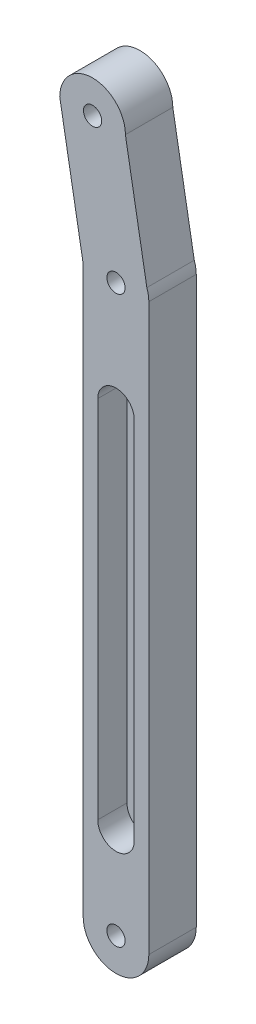
ISO-10303-21;
HEADER;
FILE_DESCRIPTION(('STEP AP214'),'2;1');
FILE_NAME('part.step','',(''),(''),'','','');
FILE_SCHEMA(('AUTOMOTIVE_DESIGN { 1 0 10303 214 1 1 1 1 }'));
ENDSEC;
DATA;
#1=APPLICATION_CONTEXT('core data for automotive mechanical design processes');
#2=APPLICATION_PROTOCOL_DEFINITION('international standard','automotive_design',2000,#1);
#3=PRODUCT_CONTEXT('',#1,'mechanical');
#4=PRODUCT('Part','Part','',(#3));
#5=PRODUCT_RELATED_PRODUCT_CATEGORY('part','',(#4));
#6=PRODUCT_DEFINITION_FORMATION('','',#4);
#7=PRODUCT_DEFINITION_CONTEXT('part definition',#1,'design');
#8=PRODUCT_DEFINITION('design','',#6,#7);
#9=PRODUCT_DEFINITION_SHAPE('','',#8);
#10=(LENGTH_UNIT() NAMED_UNIT(*) SI_UNIT(.MILLI.,.METRE.));
#11=(NAMED_UNIT(*) PLANE_ANGLE_UNIT() SI_UNIT($,.RADIAN.));
#12=(NAMED_UNIT(*) SI_UNIT($,.STERADIAN.) SOLID_ANGLE_UNIT());
#13=UNCERTAINTY_MEASURE_WITH_UNIT(LENGTH_MEASURE(1.E-05),#10,'distance_accuracy_value','');
#14=(GEOMETRIC_REPRESENTATION_CONTEXT(3) GLOBAL_UNCERTAINTY_ASSIGNED_CONTEXT((#13)) GLOBAL_UNIT_ASSIGNED_CONTEXT((#10,
#11,#12)) REPRESENTATION_CONTEXT('',''));
#15=CARTESIAN_POINT('',(0.,0.,0.));
#16=DIRECTION('',(0.,0.,1.));
#17=DIRECTION('',(1.,0.,0.));
#18=AXIS2_PLACEMENT_3D('',#15,#16,#17);
#19=CARTESIAN_POINT('',(-5.32859756116372,-42.3623506112515,13.));
#20=DIRECTION('',(0.,0.,1.));
#21=DIRECTION('',(1.,0.,0.));
#22=AXIS2_PLACEMENT_3D('',#19,#20,#21);
#23=PLANE('',#22);
#24=CARTESIAN_POINT('',(-5.32859756116371,82.6376493887485,13.));
#25=DIRECTION('',(0.,0.,1.));
#26=DIRECTION('',(1.,0.,0.));
#27=AXIS2_PLACEMENT_3D('',#24,#25,#26);
#28=CIRCLE('',#27,5.);
#29=CARTESIAN_POINT('',(-0.328597561163714,82.6376493887485,13.));
#30=VERTEX_POINT('',#29);
#31=CARTESIAN_POINT('',(-10.3285975611637,82.6376493887486,13.));
#32=VERTEX_POINT('',#31);
#33=EDGE_CURVE('E46',#30,#32,#28,.T.);
#34=ORIENTED_EDGE('',*,*,#33,.F.);
#35=DIRECTION('',(0.,1.,0.));
#36=VECTOR('',#35,1.);
#37=CARTESIAN_POINT('',(-0.328597561163714,82.6376493887485,13.));
#38=LINE('',#37,#36);
#39=CARTESIAN_POINT('',(-0.328597561163715,-17.3623506112515,13.));
#40=VERTEX_POINT('',#39);
#41=EDGE_CURVE('E200',#40,#30,#38,.T.);
#42=ORIENTED_EDGE('',*,*,#41,.F.);
#43=CARTESIAN_POINT('',(-5.32859756116372,-17.3623506112515,13.));
#44=DIRECTION('',(0.,0.,1.));
#45=DIRECTION('',(1.,0.,0.));
#46=AXIS2_PLACEMENT_3D('',#43,#44,#45);
#47=CIRCLE('',#46,5.);
#48=CARTESIAN_POINT('',(-10.3285975611637,-17.3623506112515,13.));
#49=VERTEX_POINT('',#48);
#50=EDGE_CURVE('E204',#49,#40,#47,.T.);
#51=ORIENTED_EDGE('',*,*,#50,.F.);
#52=DIRECTION('',(0.,-1.,0.));
#53=VECTOR('',#52,1.);
#54=CARTESIAN_POINT('',(-10.3285975611637,82.6376493887485,13.));
#55=LINE('',#54,#53);
#56=EDGE_CURVE('E207',#32,#49,#55,.T.);
#57=ORIENTED_EDGE('',*,*,#56,.F.);
#58=EDGE_LOOP('',(#34,#42,#51,#57));
#59=FACE_BOUND('',#58,.T.);
#60=CARTESIAN_POINT('',(-5.32859756116372,-42.3623506112515,13.));
#61=DIRECTION('',(0.,0.,1.));
#62=DIRECTION('',(1.,0.,0.));
#63=AXIS2_PLACEMENT_3D('',#60,#61,#62);
#64=CIRCLE('',#63,2.5);
#65=CARTESIAN_POINT('',(-2.82859756116372,-42.3623506112515,13.));
#66=VERTEX_POINT('',#65);
#67=EDGE_CURVE('E175',#66,#66,#64,.T.);
#68=ORIENTED_EDGE('',*,*,#67,.F.);
#69=EDGE_LOOP('',(#68));
#70=FACE_BOUND('',#69,.T.);
#71=DIRECTION('',(0.173648177666924,-0.984807753012209,0.));
#72=VECTOR('',#71,1.);
#73=CARTESIAN_POINT('',(-20.7535801348399,149.0755362502,13.));
#74=LINE('',#73,#72);
#75=CARTESIAN_POINT('',(-20.7535801348399,149.0755362502,13.));
#76=VERTEX_POINT('',#75);
#77=CARTESIAN_POINT('',(-14.3285975611637,112.637649388749,13.));
#78=VERTEX_POINT('',#77);
#79=EDGE_CURVE('E148',#76,#78,#74,.T.);
#80=ORIENTED_EDGE('',*,*,#79,.T.);
#81=DIRECTION('',(0.,-1.,0.));
#82=VECTOR('',#81,1.);
#83=CARTESIAN_POINT('',(-14.3285975611637,112.637649388749,13.));
#84=LINE('',#83,#82);
#85=CARTESIAN_POINT('',(-14.3285975611637,-42.3623506112515,13.));
#86=VERTEX_POINT('',#85);
#87=EDGE_CURVE('E93',#78,#86,#84,.T.);
#88=ORIENTED_EDGE('',*,*,#87,.T.);
#89=CARTESIAN_POINT('',(-5.32859756116372,-42.3623506112515,13.));
#90=DIRECTION('',(0.,0.,1.));
#91=DIRECTION('',(1.,0.,0.));
#92=AXIS2_PLACEMENT_3D('',#89,#90,#91);
#93=CIRCLE('',#92,9.);
#94=CARTESIAN_POINT('',(3.67140243883628,-42.3623506112515,13.));
#95=VERTEX_POINT('',#94);
#96=EDGE_CURVE('E160',#86,#95,#93,.T.);
#97=ORIENTED_EDGE('',*,*,#96,.T.);
#98=DIRECTION('',(0.,1.,0.));
#99=VECTOR('',#98,1.);
#100=CARTESIAN_POINT('',(3.67140243883628,-42.3623506112515,13.));
#101=LINE('',#100,#99);
#102=CARTESIAN_POINT('',(3.67140243883628,112.637649388749,13.));
#103=VERTEX_POINT('',#102);
#104=EDGE_CURVE('E113',#95,#103,#101,.T.);
#105=ORIENTED_EDGE('',*,*,#104,.T.);
#106=CARTESIAN_POINT('',(-5.32859756116372,112.637649388749,13.));
#107=DIRECTION('',(0.,0.,1.));
#108=DIRECTION('',(1.,0.,0.));
#109=AXIS2_PLACEMENT_3D('',#106,#107,#108);
#110=CIRCLE('',#109,9.);
#111=CARTESIAN_POINT('',(3.12863602590949,115.715830678679,13.));
#112=VERTEX_POINT('',#111);
#113=EDGE_CURVE('E106',#103,#112,#110,.T.);
#114=ORIENTED_EDGE('',*,*,#113,.T.);
#115=DIRECTION('',(-0.173648177666924,0.984807753012209,0.));
#116=VECTOR('',#115,1.);
#117=CARTESIAN_POINT('',(3.12863602590949,115.715830678679,13.));
#118=LINE('',#117,#116);
#119=CARTESIAN_POINT('',(-2.75358013483992,149.0755362502,13.));
#120=VERTEX_POINT('',#119);
#121=EDGE_CURVE('E110',#112,#120,#118,.T.);
#122=ORIENTED_EDGE('',*,*,#121,.T.);
#123=CARTESIAN_POINT('',(-11.7535801348399,149.0755362502,13.));
#124=DIRECTION('',(0.,0.,1.));
#125=DIRECTION('',(1.,0.,0.));
#126=AXIS2_PLACEMENT_3D('',#123,#124,#125);
#127=CIRCLE('',#126,9.);
#128=EDGE_CURVE('E55',#120,#76,#127,.T.);
#129=ORIENTED_EDGE('',*,*,#128,.T.);
#130=EDGE_LOOP('',(#80,#88,#97,#105,#114,#122,#129));
#131=FACE_BOUND('',#130,.T.);
#132=CARTESIAN_POINT('',(-5.32859756116372,112.637649388749,13.));
#133=DIRECTION('',(0.,0.,1.));
#134=DIRECTION('',(1.,0.,0.));
#135=AXIS2_PLACEMENT_3D('',#132,#133,#134);
#136=CIRCLE('',#135,2.5);
#137=CARTESIAN_POINT('',(-2.82859756116372,112.637649388749,13.));
#138=VERTEX_POINT('',#137);
#139=EDGE_CURVE('E138',#138,#138,#136,.T.);
#140=ORIENTED_EDGE('',*,*,#139,.F.);
#141=EDGE_LOOP('',(#140));
#142=FACE_BOUND('',#141,.T.);
#143=CARTESIAN_POINT('',(-11.7535801348399,149.0755362502,13.));
#144=DIRECTION('',(0.,0.,1.));
#145=DIRECTION('',(1.,0.,0.));
#146=AXIS2_PLACEMENT_3D('',#143,#144,#145);
#147=CIRCLE('',#146,2.5);
#148=CARTESIAN_POINT('',(-9.25358013483992,149.0755362502,13.));
#149=VERTEX_POINT('',#148);
#150=EDGE_CURVE('E181',#149,#149,#147,.T.);
#151=ORIENTED_EDGE('',*,*,#150,.F.);
#152=EDGE_LOOP('',(#151));
#153=FACE_BOUND('',#152,.T.);
#154=ADVANCED_FACE('F31',(#59,#70,#131,#142,#153),#23,.T.);
#155=CARTESIAN_POINT('',(-5.32859756116372,-42.3623506112515,0.));
#156=DIRECTION('',(0.,0.,1.));
#157=DIRECTION('',(1.,0.,0.));
#158=AXIS2_PLACEMENT_3D('',#155,#156,#157);
#159=PLANE('',#158);
#160=CARTESIAN_POINT('',(-5.32859756116372,-42.3623506112515,0.));
#161=DIRECTION('',(0.,0.,1.));
#162=DIRECTION('',(1.,0.,0.));
#163=AXIS2_PLACEMENT_3D('',#160,#161,#162);
#164=CIRCLE('',#163,2.5);
#165=CARTESIAN_POINT('',(-2.82859756116372,-42.3623506112515,0.));
#166=VERTEX_POINT('',#165);
#167=EDGE_CURVE('E178',#166,#166,#164,.T.);
#168=ORIENTED_EDGE('',*,*,#167,.T.);
#169=EDGE_LOOP('',(#168));
#170=FACE_BOUND('',#169,.T.);
#171=DIRECTION('',(0.173648177666924,-0.984807753012209,0.));
#172=VECTOR('',#171,1.);
#173=CARTESIAN_POINT('',(-20.7535801348399,149.0755362502,0.));
#174=LINE('',#173,#172);
#175=CARTESIAN_POINT('',(-20.7535801348399,149.0755362502,0.));
#176=VERTEX_POINT('',#175);
#177=CARTESIAN_POINT('',(-14.3285975611637,112.637649388749,0.));
#178=VERTEX_POINT('',#177);
#179=EDGE_CURVE('E134',#176,#178,#174,.T.);
#180=ORIENTED_EDGE('',*,*,#179,.F.);
#181=CARTESIAN_POINT('',(-11.7535801348399,149.0755362502,0.));
#182=DIRECTION('',(0.,0.,1.));
#183=DIRECTION('',(1.,0.,0.));
#184=AXIS2_PLACEMENT_3D('',#181,#182,#183);
#185=CIRCLE('',#184,9.);
#186=CARTESIAN_POINT('',(-2.75358013483992,149.0755362502,0.));
#187=VERTEX_POINT('',#186);
#188=EDGE_CURVE('E85',#187,#176,#185,.T.);
#189=ORIENTED_EDGE('',*,*,#188,.F.);
#190=DIRECTION('',(-0.173648177666924,0.984807753012209,0.));
#191=VECTOR('',#190,1.);
#192=CARTESIAN_POINT('',(3.12863602590949,115.715830678679,0.));
#193=LINE('',#192,#191);
#194=CARTESIAN_POINT('',(3.12863602590949,115.715830678679,0.));
#195=VERTEX_POINT('',#194);
#196=EDGE_CURVE('E145',#195,#187,#193,.T.);
#197=ORIENTED_EDGE('',*,*,#196,.F.);
#198=CARTESIAN_POINT('',(-5.32859756116372,112.637649388749,0.));
#199=DIRECTION('',(0.,0.,1.));
#200=DIRECTION('',(1.,0.,0.));
#201=AXIS2_PLACEMENT_3D('',#198,#199,#200);
#202=CIRCLE('',#201,9.);
#203=CARTESIAN_POINT('',(3.67140243883628,112.637649388749,0.));
#204=VERTEX_POINT('',#203);
#205=EDGE_CURVE('E122',#204,#195,#202,.T.);
#206=ORIENTED_EDGE('',*,*,#205,.F.);
#207=DIRECTION('',(0.,1.,0.));
#208=VECTOR('',#207,1.);
#209=CARTESIAN_POINT('',(3.67140243883628,-42.3623506112515,0.));
#210=LINE('',#209,#208);
#211=CARTESIAN_POINT('',(3.67140243883628,-42.3623506112515,0.));
#212=VERTEX_POINT('',#211);
#213=EDGE_CURVE('E142',#212,#204,#210,.T.);
#214=ORIENTED_EDGE('',*,*,#213,.F.);
#215=CARTESIAN_POINT('',(-5.32859756116372,-42.3623506112515,0.));
#216=DIRECTION('',(0.,0.,1.));
#217=DIRECTION('',(1.,0.,0.));
#218=AXIS2_PLACEMENT_3D('',#215,#216,#217);
#219=CIRCLE('',#218,9.);
#220=CARTESIAN_POINT('',(-14.3285975611637,-42.3623506112515,0.));
#221=VERTEX_POINT('',#220);
#222=EDGE_CURVE('E140',#221,#212,#219,.T.);
#223=ORIENTED_EDGE('',*,*,#222,.F.);
#224=DIRECTION('',(0.,-1.,0.));
#225=VECTOR('',#224,1.);
#226=CARTESIAN_POINT('',(-14.3285975611637,112.637649388749,0.));
#227=LINE('',#226,#225);
#228=EDGE_CURVE('E137',#178,#221,#227,.T.);
#229=ORIENTED_EDGE('',*,*,#228,.F.);
#230=EDGE_LOOP('',(#180,#189,#197,#206,#214,#223,#229));
#231=FACE_BOUND('',#230,.T.);
#232=CARTESIAN_POINT('',(-5.32859756116372,112.637649388749,0.));
#233=DIRECTION('',(0.,0.,1.));
#234=DIRECTION('',(1.,0.,0.));
#235=AXIS2_PLACEMENT_3D('',#232,#233,#234);
#236=CIRCLE('',#235,2.5);
#237=CARTESIAN_POINT('',(-2.82859756116372,112.637649388749,0.));
#238=VERTEX_POINT('',#237);
#239=EDGE_CURVE('E172',#238,#238,#236,.T.);
#240=ORIENTED_EDGE('',*,*,#239,.T.);
#241=EDGE_LOOP('',(#240));
#242=FACE_BOUND('',#241,.T.);
#243=CARTESIAN_POINT('',(-11.7535801348399,149.0755362502,0.));
#244=DIRECTION('',(0.,0.,1.));
#245=DIRECTION('',(1.,0.,0.));
#246=AXIS2_PLACEMENT_3D('',#243,#244,#245);
#247=CIRCLE('',#246,2.5);
#248=CARTESIAN_POINT('',(-9.25358013483992,149.0755362502,0.));
#249=VERTEX_POINT('',#248);
#250=EDGE_CURVE('E184',#249,#249,#247,.T.);
#251=ORIENTED_EDGE('',*,*,#250,.T.);
#252=EDGE_LOOP('',(#251));
#253=FACE_BOUND('',#252,.T.);
#254=ADVANCED_FACE('F164',(#170,#231,#242,#253),#159,.F.);
#255=CARTESIAN_POINT('',(-20.7535801348399,149.0755362502,13.));
#256=DIRECTION('',(0.984807753012209,0.173648177666924,0.));
#257=DIRECTION('',(-0.173648177666924,0.984807753012209,0.));
#258=AXIS2_PLACEMENT_3D('',#255,#256,#257);
#259=PLANE('',#258);
#260=ORIENTED_EDGE('',*,*,#179,.T.);
#261=DIRECTION('',(0.,0.,-1.));
#262=VECTOR('',#261,1.);
#263=CARTESIAN_POINT('',(-14.3285975611637,112.637649388749,13.));
#264=LINE('',#263,#262);
#265=EDGE_CURVE('E11',#78,#178,#264,.T.);
#266=ORIENTED_EDGE('',*,*,#265,.F.);
#267=ORIENTED_EDGE('',*,*,#79,.F.);
#268=DIRECTION('',(0.,0.,-1.));
#269=VECTOR('',#268,1.);
#270=CARTESIAN_POINT('',(-20.7535801348399,149.0755362502,13.));
#271=LINE('',#270,#269);
#272=EDGE_CURVE('E130',#76,#176,#271,.T.);
#273=ORIENTED_EDGE('',*,*,#272,.T.);
#274=EDGE_LOOP('',(#260,#266,#267,#273));
#275=FACE_BOUND('',#274,.T.);
#276=ADVANCED_FACE('F33',(#275),#259,.F.);
#277=CARTESIAN_POINT('',(-14.3285975611637,112.637649388749,13.));
#278=DIRECTION('',(1.,0.,0.));
#279=DIRECTION('',(0.,1.,0.));
#280=AXIS2_PLACEMENT_3D('',#277,#278,#279);
#281=PLANE('',#280);
#282=ORIENTED_EDGE('',*,*,#228,.T.);
#283=DIRECTION('',(0.,0.,-1.));
#284=VECTOR('',#283,1.);
#285=CARTESIAN_POINT('',(-14.3285975611637,-42.3623506112515,13.));
#286=LINE('',#285,#284);
#287=EDGE_CURVE('E39',#86,#221,#286,.T.);
#288=ORIENTED_EDGE('',*,*,#287,.F.);
#289=ORIENTED_EDGE('',*,*,#87,.F.);
#290=ORIENTED_EDGE('',*,*,#265,.T.);
#291=EDGE_LOOP('',(#282,#288,#289,#290));
#292=FACE_BOUND('',#291,.T.);
#293=ADVANCED_FACE('F281',(#292),#281,.F.);
#294=CARTESIAN_POINT('',(-5.32859756116372,-42.3623506112515,13.));
#295=DIRECTION('',(0.,0.,-1.));
#296=DIRECTION('',(-1.,0.,0.));
#297=AXIS2_PLACEMENT_3D('',#294,#295,#296);
#298=CYLINDRICAL_SURFACE('',#297,9.);
#299=ORIENTED_EDGE('',*,*,#222,.T.);
#300=DIRECTION('',(0.,0.,-1.));
#301=VECTOR('',#300,1.);
#302=CARTESIAN_POINT('',(3.67140243883628,-42.3623506112515,13.));
#303=LINE('',#302,#301);
#304=EDGE_CURVE('E152',#95,#212,#303,.T.);
#305=ORIENTED_EDGE('',*,*,#304,.F.);
#306=ORIENTED_EDGE('',*,*,#96,.F.);
#307=ORIENTED_EDGE('',*,*,#287,.T.);
#308=EDGE_LOOP('',(#299,#305,#306,#307));
#309=FACE_BOUND('',#308,.T.);
#310=ADVANCED_FACE('F158',(#309),#298,.T.);
#311=CARTESIAN_POINT('',(3.67140243883628,-42.3623506112515,13.));
#312=DIRECTION('',(-1.,0.,0.));
#313=DIRECTION('',(0.,-1.,0.));
#314=AXIS2_PLACEMENT_3D('',#311,#312,#313);
#315=PLANE('',#314);
#316=ORIENTED_EDGE('',*,*,#213,.T.);
#317=DIRECTION('',(0.,0.,-1.));
#318=VECTOR('',#317,1.);
#319=CARTESIAN_POINT('',(3.67140243883628,112.637649388749,13.));
#320=LINE('',#319,#318);
#321=EDGE_CURVE('E125',#103,#204,#320,.T.);
#322=ORIENTED_EDGE('',*,*,#321,.F.);
#323=ORIENTED_EDGE('',*,*,#104,.F.);
#324=ORIENTED_EDGE('',*,*,#304,.T.);
#325=EDGE_LOOP('',(#316,#322,#323,#324));
#326=FACE_BOUND('',#325,.T.);
#327=ADVANCED_FACE('F167',(#326),#315,.F.);
#328=CARTESIAN_POINT('',(-5.32859756116372,112.637649388749,13.));
#329=DIRECTION('',(0.,0.,-1.));
#330=DIRECTION('',(-1.,0.,0.));
#331=AXIS2_PLACEMENT_3D('',#328,#329,#330);
#332=CYLINDRICAL_SURFACE('',#331,9.);
#333=ORIENTED_EDGE('',*,*,#205,.T.);
#334=DIRECTION('',(0.,0.,-1.));
#335=VECTOR('',#334,1.);
#336=CARTESIAN_POINT('',(3.12863602590949,115.715830678679,13.));
#337=LINE('',#336,#335);
#338=EDGE_CURVE('E119',#112,#195,#337,.T.);
#339=ORIENTED_EDGE('',*,*,#338,.F.);
#340=ORIENTED_EDGE('',*,*,#113,.F.);
#341=ORIENTED_EDGE('',*,*,#321,.T.);
#342=EDGE_LOOP('',(#333,#339,#340,#341));
#343=FACE_BOUND('',#342,.T.);
#344=ADVANCED_FACE('F120',(#343),#332,.T.);
#345=CARTESIAN_POINT('',(3.12863602590949,115.715830678679,13.));
#346=DIRECTION('',(-0.984807753012209,-0.173648177666924,0.));
#347=DIRECTION('',(0.173648177666924,-0.984807753012209,0.));
#348=AXIS2_PLACEMENT_3D('',#345,#346,#347);
#349=PLANE('',#348);
#350=ORIENTED_EDGE('',*,*,#196,.T.);
#351=DIRECTION('',(0.,0.,-1.));
#352=VECTOR('',#351,1.);
#353=CARTESIAN_POINT('',(-2.75358013483992,149.0755362502,13.));
#354=LINE('',#353,#352);
#355=EDGE_CURVE('E126',#120,#187,#354,.T.);
#356=ORIENTED_EDGE('',*,*,#355,.F.);
#357=ORIENTED_EDGE('',*,*,#121,.F.);
#358=ORIENTED_EDGE('',*,*,#338,.T.);
#359=EDGE_LOOP('',(#350,#356,#357,#358));
#360=FACE_BOUND('',#359,.T.);
#361=ADVANCED_FACE('F128',(#360),#349,.F.);
#362=CARTESIAN_POINT('',(-11.7535801348399,149.0755362502,13.));
#363=DIRECTION('',(0.,0.,-1.));
#364=DIRECTION('',(-1.,0.,0.));
#365=AXIS2_PLACEMENT_3D('',#362,#363,#364);
#366=CYLINDRICAL_SURFACE('',#365,9.);
#367=ORIENTED_EDGE('',*,*,#188,.T.);
#368=ORIENTED_EDGE('',*,*,#272,.F.);
#369=ORIENTED_EDGE('',*,*,#128,.F.);
#370=ORIENTED_EDGE('',*,*,#355,.T.);
#371=EDGE_LOOP('',(#367,#368,#369,#370));
#372=FACE_BOUND('',#371,.T.);
#373=ADVANCED_FACE('F271',(#372),#366,.T.);
#374=CARTESIAN_POINT('',(-5.32859756116372,112.637649388749,13.));
#375=DIRECTION('',(0.,0.,-1.));
#376=DIRECTION('',(-1.,0.,0.));
#377=AXIS2_PLACEMENT_3D('',#374,#375,#376);
#378=CYLINDRICAL_SURFACE('',#377,2.5);
#379=ORIENTED_EDGE('',*,*,#139,.T.);
#380=EDGE_LOOP('',(#379));
#381=FACE_BOUND('',#380,.T.);
#382=ORIENTED_EDGE('',*,*,#239,.F.);
#383=EDGE_LOOP('',(#382));
#384=FACE_BOUND('',#383,.T.);
#385=ADVANCED_FACE('F268',(#381,#384),#378,.F.);
#386=CARTESIAN_POINT('',(-5.32859756116372,-42.3623506112515,13.));
#387=DIRECTION('',(0.,0.,-1.));
#388=DIRECTION('',(-1.,0.,0.));
#389=AXIS2_PLACEMENT_3D('',#386,#387,#388);
#390=CYLINDRICAL_SURFACE('',#389,2.5);
#391=ORIENTED_EDGE('',*,*,#67,.T.);
#392=EDGE_LOOP('',(#391));
#393=FACE_BOUND('',#392,.T.);
#394=ORIENTED_EDGE('',*,*,#167,.F.);
#395=EDGE_LOOP('',(#394));
#396=FACE_BOUND('',#395,.T.);
#397=ADVANCED_FACE('F339',(#393,#396),#390,.F.);
#398=CARTESIAN_POINT('',(-11.7535801348399,149.0755362502,13.));
#399=DIRECTION('',(0.,0.,-1.));
#400=DIRECTION('',(-1.,0.,0.));
#401=AXIS2_PLACEMENT_3D('',#398,#399,#400);
#402=CYLINDRICAL_SURFACE('',#401,2.5);
#403=ORIENTED_EDGE('',*,*,#150,.T.);
#404=EDGE_LOOP('',(#403));
#405=FACE_BOUND('',#404,.T.);
#406=ORIENTED_EDGE('',*,*,#250,.F.);
#407=EDGE_LOOP('',(#406));
#408=FACE_BOUND('',#407,.T.);
#409=ADVANCED_FACE('F347',(#405,#408),#402,.F.);
#410=CARTESIAN_POINT('',(-5.32859756116371,82.6376493887485,5.));
#411=DIRECTION('',(0.,0.,1.));
#412=DIRECTION('',(1.,0.,0.));
#413=AXIS2_PLACEMENT_3D('',#410,#411,#412);
#414=CYLINDRICAL_SURFACE('',#413,5.);
#415=ORIENTED_EDGE('',*,*,#33,.T.);
#416=DIRECTION('',(0.,0.,1.));
#417=VECTOR('',#416,1.);
#418=CARTESIAN_POINT('',(-10.3285975611637,82.6376493887485,5.));
#419=LINE('',#418,#417);
#420=CARTESIAN_POINT('',(-10.3285975611637,82.6376493887485,5.));
#421=VERTEX_POINT('',#420);
#422=EDGE_CURVE('E190',#421,#32,#419,.T.);
#423=ORIENTED_EDGE('',*,*,#422,.F.);
#424=CARTESIAN_POINT('',(-5.32859756116371,82.6376493887485,5.));
#425=DIRECTION('',(0.,0.,1.));
#426=DIRECTION('',(1.,0.,0.));
#427=AXIS2_PLACEMENT_3D('',#424,#425,#426);
#428=CIRCLE('',#427,5.);
#429=CARTESIAN_POINT('',(-0.328597561163714,82.6376493887485,5.));
#430=VERTEX_POINT('',#429);
#431=EDGE_CURVE('E203',#430,#421,#428,.T.);
#432=ORIENTED_EDGE('',*,*,#431,.F.);
#433=DIRECTION('',(0.,0.,1.));
#434=VECTOR('',#433,1.);
#435=CARTESIAN_POINT('',(-0.328597561163714,82.6376493887485,5.));
#436=LINE('',#435,#434);
#437=EDGE_CURVE('E187',#430,#30,#436,.T.);
#438=ORIENTED_EDGE('',*,*,#437,.T.);
#439=EDGE_LOOP('',(#415,#423,#432,#438));
#440=FACE_BOUND('',#439,.T.);
#441=ADVANCED_FACE('F228',(#440),#414,.F.);
#442=CARTESIAN_POINT('',(-0.328597561163714,82.6376493887485,5.));
#443=DIRECTION('',(1.,0.,0.));
#444=DIRECTION('',(0.,1.,0.));
#445=AXIS2_PLACEMENT_3D('',#442,#443,#444);
#446=PLANE('',#445);
#447=ORIENTED_EDGE('',*,*,#41,.T.);
#448=ORIENTED_EDGE('',*,*,#437,.F.);
#449=DIRECTION('',(0.,1.,0.));
#450=VECTOR('',#449,1.);
#451=CARTESIAN_POINT('',(-0.328597561163714,82.6376493887485,5.));
#452=LINE('',#451,#450);
#453=CARTESIAN_POINT('',(-0.328597561163715,-17.3623506112515,5.));
#454=VERTEX_POINT('',#453);
#455=EDGE_CURVE('E193',#454,#430,#452,.T.);
#456=ORIENTED_EDGE('',*,*,#455,.F.);
#457=DIRECTION('',(0.,0.,1.));
#458=VECTOR('',#457,1.);
#459=CARTESIAN_POINT('',(-0.328597561163715,-17.3623506112515,5.));
#460=LINE('',#459,#458);
#461=EDGE_CURVE('E196',#454,#40,#460,.T.);
#462=ORIENTED_EDGE('',*,*,#461,.T.);
#463=EDGE_LOOP('',(#447,#448,#456,#462));
#464=FACE_BOUND('',#463,.T.);
#465=ADVANCED_FACE('F239',(#464),#446,.F.);
#466=CARTESIAN_POINT('',(-5.32859756116372,-17.3623506112515,5.));
#467=DIRECTION('',(0.,0.,1.));
#468=DIRECTION('',(1.,0.,0.));
#469=AXIS2_PLACEMENT_3D('',#466,#467,#468);
#470=CYLINDRICAL_SURFACE('',#469,5.);
#471=ORIENTED_EDGE('',*,*,#50,.T.);
#472=ORIENTED_EDGE('',*,*,#461,.F.);
#473=CARTESIAN_POINT('',(-5.32859756116372,-17.3623506112515,5.));
#474=DIRECTION('',(0.,0.,1.));
#475=DIRECTION('',(1.,0.,0.));
#476=AXIS2_PLACEMENT_3D('',#473,#474,#475);
#477=CIRCLE('',#476,5.);
#478=CARTESIAN_POINT('',(-10.3285975611637,-17.3623506112515,5.));
#479=VERTEX_POINT('',#478);
#480=EDGE_CURVE('E213',#479,#454,#477,.T.);
#481=ORIENTED_EDGE('',*,*,#480,.F.);
#482=DIRECTION('',(0.,0.,1.));
#483=VECTOR('',#482,1.);
#484=CARTESIAN_POINT('',(-10.3285975611637,-17.3623506112515,5.));
#485=LINE('',#484,#483);
#486=EDGE_CURVE('E192',#479,#49,#485,.T.);
#487=ORIENTED_EDGE('',*,*,#486,.T.);
#488=EDGE_LOOP('',(#471,#472,#481,#487));
#489=FACE_BOUND('',#488,.T.);
#490=ADVANCED_FACE('F244',(#489),#470,.F.);
#491=CARTESIAN_POINT('',(-10.3285975611637,82.6376493887485,5.));
#492=DIRECTION('',(-1.,0.,0.));
#493=DIRECTION('',(0.,0.,1.));
#494=AXIS2_PLACEMENT_3D('',#491,#492,#493);
#495=PLANE('',#494);
#496=ORIENTED_EDGE('',*,*,#56,.T.);
#497=ORIENTED_EDGE('',*,*,#486,.F.);
#498=DIRECTION('',(0.,-1.,0.));
#499=VECTOR('',#498,1.);
#500=CARTESIAN_POINT('',(-10.3285975611637,82.6376493887485,5.));
#501=LINE('',#500,#499);
#502=EDGE_CURVE('E216',#421,#479,#501,.T.);
#503=ORIENTED_EDGE('',*,*,#502,.F.);
#504=ORIENTED_EDGE('',*,*,#422,.T.);
#505=EDGE_LOOP('',(#496,#497,#503,#504));
#506=FACE_BOUND('',#505,.T.);
#507=ADVANCED_FACE('F250',(#506),#495,.F.);
#508=CARTESIAN_POINT('',(-5.32859756116371,82.6376493887485,5.));
#509=DIRECTION('',(0.,0.,1.));
#510=DIRECTION('',(1.,0.,0.));
#511=AXIS2_PLACEMENT_3D('',#508,#509,#510);
#512=PLANE('',#511);
#513=ORIENTED_EDGE('',*,*,#431,.T.);
#514=ORIENTED_EDGE('',*,*,#502,.T.);
#515=ORIENTED_EDGE('',*,*,#480,.T.);
#516=ORIENTED_EDGE('',*,*,#455,.T.);
#517=EDGE_LOOP('',(#513,#514,#515,#516));
#518=FACE_BOUND('',#517,.T.);
#519=ADVANCED_FACE('F223',(#518),#512,.T.);
#520=CLOSED_SHELL('',(#154,#254,#276,#293,#310,#327,#344,#361,#373,#385,#397,#409,#441,#465,
#490,#507,#519));
#521=MANIFOLD_SOLID_BREP('B2',#520);
#522=ADVANCED_BREP_SHAPE_REPRESENTATION('',(#18,#521),#14);
#523=SHAPE_DEFINITION_REPRESENTATION(#9,#522);
ENDSEC;
END-ISO-10303-21;
